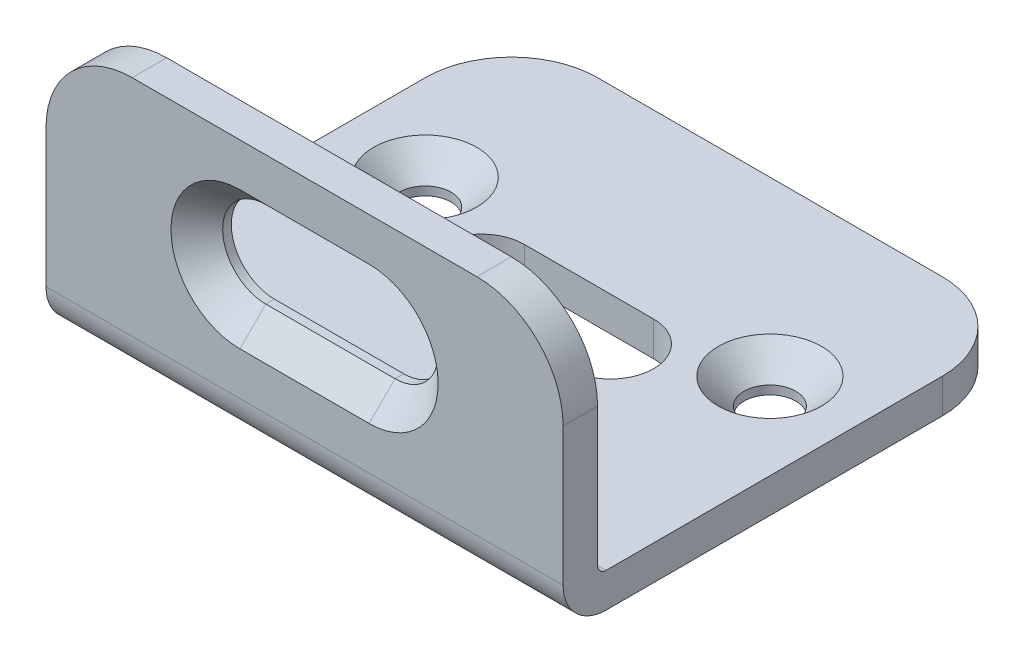
ISO-10303-21;
HEADER;
FILE_DESCRIPTION(('STEP AP214'),'2;1');
FILE_NAME('part.step','',(''),(''),'','','');
FILE_SCHEMA(('AUTOMOTIVE_DESIGN { 1 0 10303 214 1 1 1 1 }'));
ENDSEC;
DATA;
#1=APPLICATION_CONTEXT('core data for automotive mechanical design processes');
#2=APPLICATION_PROTOCOL_DEFINITION('international standard','automotive_design',2000,#1);
#3=PRODUCT_CONTEXT('',#1,'mechanical');
#4=PRODUCT('Part','Part','',(#3));
#5=PRODUCT_RELATED_PRODUCT_CATEGORY('part','',(#4));
#6=PRODUCT_DEFINITION_FORMATION('','',#4);
#7=PRODUCT_DEFINITION_CONTEXT('part definition',#1,'design');
#8=PRODUCT_DEFINITION('design','',#6,#7);
#9=PRODUCT_DEFINITION_SHAPE('','',#8);
#10=(LENGTH_UNIT() NAMED_UNIT(*) SI_UNIT(.MILLI.,.METRE.));
#11=(NAMED_UNIT(*) PLANE_ANGLE_UNIT() SI_UNIT($,.RADIAN.));
#12=(NAMED_UNIT(*) SI_UNIT($,.STERADIAN.) SOLID_ANGLE_UNIT());
#13=UNCERTAINTY_MEASURE_WITH_UNIT(LENGTH_MEASURE(1.E-05),#10,'distance_accuracy_value','');
#14=(GEOMETRIC_REPRESENTATION_CONTEXT(3) GLOBAL_UNCERTAINTY_ASSIGNED_CONTEXT((#13)) GLOBAL_UNIT_ASSIGNED_CONTEXT((#10,
#11,#12)) REPRESENTATION_CONTEXT('',''));
#15=CARTESIAN_POINT('',(0.,0.,0.));
#16=DIRECTION('',(0.,0.,1.));
#17=DIRECTION('',(1.,0.,0.));
#18=AXIS2_PLACEMENT_3D('',#15,#16,#17);
#19=CARTESIAN_POINT('',(22.5,14.,0.));
#20=DIRECTION('',(0.,0.,1.));
#21=DIRECTION('',(1.,0.,0.));
#22=AXIS2_PLACEMENT_3D('',#19,#20,#21);
#23=CYLINDRICAL_SURFACE('',#22,5.);
#24=CARTESIAN_POINT('',(22.5,14.,1.0000000000332));
#25=DIRECTION('',(0.,0.,1.));
#26=DIRECTION('',(1.,0.,0.));
#27=AXIS2_PLACEMENT_3D('',#24,#25,#26);
#28=CIRCLE('',#27,4.99999999991814);
#29=CARTESIAN_POINT('',(22.5,18.9999999999795,1.00000000000828));
#30=VERTEX_POINT('',#29);
#31=CARTESIAN_POINT('',(22.5,9.00000000002046,1.00000000000828));
#32=VERTEX_POINT('',#31);
#33=EDGE_CURVE('E188',#30,#32,#28,.T.);
#34=ORIENTED_EDGE('',*,*,#33,.T.);
#35=DIRECTION('',(0.,0.,1.));
#36=VECTOR('',#35,1.);
#37=CARTESIAN_POINT('',(22.5,9.,0.));
#38=LINE('',#37,#36);
#39=CARTESIAN_POINT('',(22.5,9.,0.));
#40=VERTEX_POINT('',#39);
#41=EDGE_CURVE('E140',#32,#40,#38,.F.);
#42=ORIENTED_EDGE('',*,*,#41,.T.);
#43=CARTESIAN_POINT('',(22.5,14.,0.));
#44=DIRECTION('',(0.,0.,1.));
#45=DIRECTION('',(1.,0.,0.));
#46=AXIS2_PLACEMENT_3D('',#43,#44,#45);
#47=CIRCLE('',#46,5.);
#48=CARTESIAN_POINT('',(22.5,19.,0.));
#49=VERTEX_POINT('',#48);
#50=EDGE_CURVE('E20',#40,#49,#47,.F.);
#51=ORIENTED_EDGE('',*,*,#50,.T.);
#52=DIRECTION('',(0.,0.,1.));
#53=VECTOR('',#52,1.);
#54=CARTESIAN_POINT('',(22.5,19.,0.));
#55=LINE('',#54,#53);
#56=EDGE_CURVE('E145',#49,#30,#55,.T.);
#57=ORIENTED_EDGE('',*,*,#56,.T.);
#58=EDGE_LOOP('',(#34,#42,#51,#57));
#59=FACE_BOUND('',#58,.T.);
#60=ADVANCED_FACE('F17',(#59),#23,.F.);
#61=CARTESIAN_POINT('',(37.5,19.,0.));
#62=DIRECTION('',(0.,1.,0.));
#63=DIRECTION('',(-1.,0.,0.));
#64=AXIS2_PLACEMENT_3D('',#61,#62,#63);
#65=PLANE('',#64);
#66=DIRECTION('',(1.,0.,0.));
#67=VECTOR('',#66,1.);
#68=CARTESIAN_POINT('',(37.5,19.,0.999999999999974));
#69=LINE('',#68,#67);
#70=CARTESIAN_POINT('',(37.5,18.9999999999633,0.999999999982258));
#71=VERTEX_POINT('',#70);
#72=EDGE_CURVE('E158',#30,#71,#69,.T.);
#73=ORIENTED_EDGE('',*,*,#72,.F.);
#74=ORIENTED_EDGE('',*,*,#56,.F.);
#75=DIRECTION('',(1.,0.,0.));
#76=VECTOR('',#75,1.);
#77=CARTESIAN_POINT('',(60.,19.,0.));
#78=LINE('',#77,#76);
#79=CARTESIAN_POINT('',(37.5,19.,0.));
#80=VERTEX_POINT('',#79);
#81=EDGE_CURVE('E150',#49,#80,#78,.T.);
#82=ORIENTED_EDGE('',*,*,#81,.T.);
#83=DIRECTION('',(0.,0.,1.));
#84=VECTOR('',#83,1.);
#85=CARTESIAN_POINT('',(37.5,19.,0.));
#86=LINE('',#85,#84);
#87=EDGE_CURVE('E160',#80,#71,#86,.T.);
#88=ORIENTED_EDGE('',*,*,#87,.T.);
#89=EDGE_LOOP('',(#73,#74,#82,#88));
#90=FACE_BOUND('',#89,.T.);
#91=ADVANCED_FACE('F154',(#90),#65,.F.);
#92=CARTESIAN_POINT('',(37.5,14.,0.));
#93=DIRECTION('',(0.,0.,1.));
#94=DIRECTION('',(1.,0.,0.));
#95=AXIS2_PLACEMENT_3D('',#92,#93,#94);
#96=CYLINDRICAL_SURFACE('',#95,5.);
#97=CARTESIAN_POINT('',(37.5,14.,0.));
#98=DIRECTION('',(0.,0.,1.));
#99=DIRECTION('',(1.,0.,0.));
#100=AXIS2_PLACEMENT_3D('',#97,#98,#99);
#101=CIRCLE('',#100,5.);
#102=CARTESIAN_POINT('',(37.5,9.,0.));
#103=VERTEX_POINT('',#102);
#104=EDGE_CURVE('E163',#80,#103,#101,.F.);
#105=ORIENTED_EDGE('',*,*,#104,.T.);
#106=DIRECTION('',(0.,0.,1.));
#107=VECTOR('',#106,1.);
#108=CARTESIAN_POINT('',(37.5,9.,0.));
#109=LINE('',#108,#107);
#110=CARTESIAN_POINT('',(37.5,9.00000000000966,1.00000000000828));
#111=VERTEX_POINT('',#110);
#112=EDGE_CURVE('E183',#103,#111,#109,.T.);
#113=ORIENTED_EDGE('',*,*,#112,.T.);
#114=CARTESIAN_POINT('',(37.5,14.,1.0000000000332));
#115=DIRECTION('',(0.,0.,1.));
#116=DIRECTION('',(1.,0.,0.));
#117=AXIS2_PLACEMENT_3D('',#114,#115,#116);
#118=CIRCLE('',#117,4.99999999996134);
#119=EDGE_CURVE('E169',#111,#71,#118,.T.);
#120=ORIENTED_EDGE('',*,*,#119,.T.);
#121=ORIENTED_EDGE('',*,*,#87,.F.);
#122=EDGE_LOOP('',(#105,#113,#120,#121));
#123=FACE_BOUND('',#122,.T.);
#124=ADVANCED_FACE('F297',(#123),#96,.F.);
#125=CARTESIAN_POINT('',(37.5,9.,0.));
#126=DIRECTION('',(0.,-1.,0.));
#127=DIRECTION('',(1.,0.,0.));
#128=AXIS2_PLACEMENT_3D('',#125,#126,#127);
#129=PLANE('',#128);
#130=DIRECTION('',(1.,0.,0.));
#131=VECTOR('',#130,1.);
#132=CARTESIAN_POINT('',(37.5,9.,0.999999999999979));
#133=LINE('',#132,#131);
#134=EDGE_CURVE('E176',#111,#32,#133,.F.);
#135=ORIENTED_EDGE('',*,*,#134,.F.);
#136=ORIENTED_EDGE('',*,*,#112,.F.);
#137=DIRECTION('',(1.,0.,0.));
#138=VECTOR('',#137,1.);
#139=CARTESIAN_POINT('',(60.,9.,0.));
#140=LINE('',#139,#138);
#141=EDGE_CURVE('E165',#103,#40,#140,.F.);
#142=ORIENTED_EDGE('',*,*,#141,.T.);
#143=ORIENTED_EDGE('',*,*,#41,.F.);
#144=EDGE_LOOP('',(#135,#136,#142,#143));
#145=FACE_BOUND('',#144,.T.);
#146=ADVANCED_FACE('F292',(#145),#129,.F.);
#147=CARTESIAN_POINT('',(60.,0.,0.));
#148=DIRECTION('',(0.,0.,1.));
#149=DIRECTION('',(1.,0.,0.));
#150=AXIS2_PLACEMENT_3D('',#147,#148,#149);
#151=PLANE('',#150);
#152=CARTESIAN_POINT('',(10.,17.,0.));
#153=DIRECTION('',(0.,0.,-1.));
#154=DIRECTION('',(-1.,0.,0.));
#155=AXIS2_PLACEMENT_3D('',#152,#153,#154);
#156=CIRCLE('',#155,10.);
#157=CARTESIAN_POINT('',(10.,27.,0.));
#158=VERTEX_POINT('',#157);
#159=CARTESIAN_POINT('',(0.,17.,0.));
#160=VERTEX_POINT('',#159);
#161=EDGE_CURVE('E282',#158,#160,#156,.F.);
#162=ORIENTED_EDGE('',*,*,#161,.F.);
#163=DIRECTION('',(1.,0.,0.));
#164=VECTOR('',#163,1.);
#165=CARTESIAN_POINT('',(60.,27.,0.));
#166=LINE('',#165,#164);
#167=CARTESIAN_POINT('',(50.,27.,0.));
#168=VERTEX_POINT('',#167);
#169=EDGE_CURVE('E179',#168,#158,#166,.F.);
#170=ORIENTED_EDGE('',*,*,#169,.F.);
#171=CARTESIAN_POINT('',(50.,17.,0.));
#172=DIRECTION('',(0.,0.,-1.));
#173=DIRECTION('',(-1.,0.,0.));
#174=AXIS2_PLACEMENT_3D('',#171,#172,#173);
#175=CIRCLE('',#174,10.);
#176=CARTESIAN_POINT('',(60.,17.,0.));
#177=VERTEX_POINT('',#176);
#178=EDGE_CURVE('E278',#177,#168,#175,.F.);
#179=ORIENTED_EDGE('',*,*,#178,.F.);
#180=DIRECTION('',(0.,1.,0.));
#181=VECTOR('',#180,1.);
#182=CARTESIAN_POINT('',(60.,1.,0.));
#183=LINE('',#182,#181);
#184=CARTESIAN_POINT('',(60.,1.,0.));
#185=VERTEX_POINT('',#184);
#186=EDGE_CURVE('E319',#185,#177,#183,.T.);
#187=ORIENTED_EDGE('',*,*,#186,.F.);
#188=DIRECTION('',(-1.,0.,0.));
#189=VECTOR('',#188,1.);
#190=CARTESIAN_POINT('',(60.,1.,0.));
#191=LINE('',#190,#189);
#192=CARTESIAN_POINT('',(0.,1.,0.));
#193=VERTEX_POINT('',#192);
#194=EDGE_CURVE('E205',#185,#193,#191,.T.);
#195=ORIENTED_EDGE('',*,*,#194,.T.);
#196=DIRECTION('',(0.,1.,0.));
#197=VECTOR('',#196,1.);
#198=CARTESIAN_POINT('',(0.,-4.,0.));
#199=LINE('',#198,#197);
#200=EDGE_CURVE('E321',#160,#193,#199,.F.);
#201=ORIENTED_EDGE('',*,*,#200,.F.);
#202=EDGE_LOOP('',(#162,#170,#179,#187,#195,#201));
#203=FACE_BOUND('',#202,.T.);
#204=ORIENTED_EDGE('',*,*,#104,.F.);
#205=ORIENTED_EDGE('',*,*,#81,.F.);
#206=ORIENTED_EDGE('',*,*,#50,.F.);
#207=ORIENTED_EDGE('',*,*,#141,.F.);
#208=EDGE_LOOP('',(#204,#205,#206,#207));
#209=FACE_BOUND('',#208,.T.);
#210=ADVANCED_FACE('F162',(#203,#209),#151,.F.);
#211=CARTESIAN_POINT('',(60.,1.,-1.));
#212=DIRECTION('',(-1.,0.,0.));
#213=DIRECTION('',(0.,0.,1.));
#214=AXIS2_PLACEMENT_3D('',#211,#212,#213);
#215=CYLINDRICAL_SURFACE('',#214,1.);
#216=ORIENTED_EDGE('',*,*,#194,.F.);
#217=CARTESIAN_POINT('',(60.,1.,-1.));
#218=DIRECTION('',(-1.,0.,0.));
#219=DIRECTION('',(0.,0.,1.));
#220=AXIS2_PLACEMENT_3D('',#217,#218,#219);
#221=CIRCLE('',#220,1.);
#222=CARTESIAN_POINT('',(60.,0.,-1.));
#223=VERTEX_POINT('',#222);
#224=EDGE_CURVE('E207',#223,#185,#221,.T.);
#225=ORIENTED_EDGE('',*,*,#224,.F.);
#226=DIRECTION('',(1.,0.,0.));
#227=VECTOR('',#226,1.);
#228=CARTESIAN_POINT('',(60.,0.,-1.));
#229=LINE('',#228,#227);
#230=CARTESIAN_POINT('',(0.,0.,-1.));
#231=VERTEX_POINT('',#230);
#232=EDGE_CURVE('E270',#223,#231,#229,.F.);
#233=ORIENTED_EDGE('',*,*,#232,.T.);
#234=CARTESIAN_POINT('',(0.,1.,-1.));
#235=DIRECTION('',(-1.,0.,0.));
#236=DIRECTION('',(0.,0.,1.));
#237=AXIS2_PLACEMENT_3D('',#234,#235,#236);
#238=CIRCLE('',#237,1.);
#239=EDGE_CURVE('E191',#193,#231,#238,.F.);
#240=ORIENTED_EDGE('',*,*,#239,.F.);
#241=EDGE_LOOP('',(#216,#225,#233,#240));
#242=FACE_BOUND('',#241,.T.);
#243=ADVANCED_FACE('F427',(#242),#215,.F.);
#244=CARTESIAN_POINT('',(22.5,14.,3.99999999996226));
#245=DIRECTION('',(0.,0.,1.));
#246=DIRECTION('',(1.,0.,0.));
#247=AXIS2_PLACEMENT_3D('',#244,#245,#246);
#248=CONICAL_SURFACE('',#247,7.99999999990404,0.785398163397448);
#249=ORIENTED_EDGE('',*,*,#33,.F.);
#250=DIRECTION('',(0.,-0.707106781186548,-0.707106781186548));
#251=VECTOR('',#250,1.);
#252=CARTESIAN_POINT('',(22.5,19.,0.999999999999984));
#253=LINE('',#252,#251);
#254=CARTESIAN_POINT('',(22.5,22.0000000000095,4.00000000000955));
#255=VERTEX_POINT('',#254);
#256=EDGE_CURVE('E190',#255,#30,#253,.T.);
#257=ORIENTED_EDGE('',*,*,#256,.F.);
#258=CARTESIAN_POINT('',(22.5,14.,4.0000000000191));
#259=DIRECTION('',(0.,0.,1.));
#260=DIRECTION('',(1.,0.,0.));
#261=AXIS2_PLACEMENT_3D('',#258,#259,#260);
#262=CIRCLE('',#261,7.99999999996089);
#263=CARTESIAN_POINT('',(22.5,5.99999999999042,4.00000000000955));
#264=VERTEX_POINT('',#263);
#265=EDGE_CURVE('E267',#264,#255,#262,.F.);
#266=ORIENTED_EDGE('',*,*,#265,.F.);
#267=DIRECTION('',(0.,-0.707106781186548,0.707106781186547));
#268=VECTOR('',#267,1.);
#269=CARTESIAN_POINT('',(22.5,9.,0.999999999999977));
#270=LINE('',#269,#268);
#271=EDGE_CURVE('E172',#32,#264,#270,.T.);
#272=ORIENTED_EDGE('',*,*,#271,.F.);
#273=EDGE_LOOP('',(#249,#257,#266,#272));
#274=FACE_BOUND('',#273,.T.);
#275=ADVANCED_FACE('F657',(#274),#248,.F.);
#276=CARTESIAN_POINT('',(37.5,19.,0.999999999999979));
#277=DIRECTION('',(0.,-0.707106781186548,0.707106781186548));
#278=DIRECTION('',(0.,-0.707106781186548,-0.707106781186548));
#279=AXIS2_PLACEMENT_3D('',#276,#277,#278);
#280=PLANE('',#279);
#281=ORIENTED_EDGE('',*,*,#256,.T.);
#282=ORIENTED_EDGE('',*,*,#72,.T.);
#283=DIRECTION('',(0.,-0.707106781186548,-0.707106781186547));
#284=VECTOR('',#283,1.);
#285=CARTESIAN_POINT('',(37.5000000000306,498976.5,498958.5));
#286=LINE('',#285,#284);
#287=CARTESIAN_POINT('',(37.5,21.9999999999907,4.0000000000191));
#288=VERTEX_POINT('',#287);
#289=EDGE_CURVE('E173',#71,#288,#286,.F.);
#290=ORIENTED_EDGE('',*,*,#289,.T.);
#291=DIRECTION('',(1.,0.,0.));
#292=VECTOR('',#291,1.);
#293=CARTESIAN_POINT('',(60.,22.,4.));
#294=LINE('',#293,#292);
#295=EDGE_CURVE('E266',#255,#288,#294,.T.);
#296=ORIENTED_EDGE('',*,*,#295,.F.);
#297=EDGE_LOOP('',(#281,#282,#290,#296));
#298=FACE_BOUND('',#297,.T.);
#299=ADVANCED_FACE('F649',(#298),#280,.T.);
#300=CARTESIAN_POINT('',(37.5,14.,3.99999999996226));
#301=DIRECTION('',(0.,0.,1.));
#302=DIRECTION('',(1.,0.,0.));
#303=AXIS2_PLACEMENT_3D('',#300,#301,#302);
#304=CONICAL_SURFACE('',#303,7.9999999998904,0.785398163387975);
#305=ORIENTED_EDGE('',*,*,#119,.F.);
#306=DIRECTION('',(0.,-0.707106781186548,0.707106781186547));
#307=VECTOR('',#306,1.);
#308=CARTESIAN_POINT('',(37.5,9.,0.999999999999979));
#309=LINE('',#308,#307);
#310=CARTESIAN_POINT('',(37.5,5.99999999999042,4.00000000000955));
#311=VERTEX_POINT('',#310);
#312=EDGE_CURVE('E180',#311,#111,#309,.F.);
#313=ORIENTED_EDGE('',*,*,#312,.F.);
#314=CARTESIAN_POINT('',(37.5,14.,4.0000000000191));
#315=DIRECTION('',(0.,0.,1.));
#316=DIRECTION('',(1.,0.,0.));
#317=AXIS2_PLACEMENT_3D('',#314,#315,#316);
#318=CIRCLE('',#317,7.99999999994724);
#319=EDGE_CURVE('E262',#288,#311,#318,.F.);
#320=ORIENTED_EDGE('',*,*,#319,.F.);
#321=ORIENTED_EDGE('',*,*,#289,.F.);
#322=EDGE_LOOP('',(#305,#313,#320,#321));
#323=FACE_BOUND('',#322,.T.);
#324=ADVANCED_FACE('F302',(#323),#304,.F.);
#325=CARTESIAN_POINT('',(37.5,9.,0.999999999999979));
#326=DIRECTION('',(0.,0.707106781186547,0.707106781186548));
#327=DIRECTION('',(0.,-0.707106781186548,0.707106781186547));
#328=AXIS2_PLACEMENT_3D('',#325,#326,#327);
#329=PLANE('',#328);
#330=ORIENTED_EDGE('',*,*,#312,.T.);
#331=ORIENTED_EDGE('',*,*,#134,.T.);
#332=ORIENTED_EDGE('',*,*,#271,.T.);
#333=DIRECTION('',(1.,0.,0.));
#334=VECTOR('',#333,1.);
#335=CARTESIAN_POINT('',(60.,6.,4.));
#336=LINE('',#335,#334);
#337=EDGE_CURVE('E265',#311,#264,#336,.F.);
#338=ORIENTED_EDGE('',*,*,#337,.F.);
#339=EDGE_LOOP('',(#330,#331,#332,#338));
#340=FACE_BOUND('',#339,.T.);
#341=ADVANCED_FACE('F339',(#340),#329,.T.);
#342=CARTESIAN_POINT('',(60.,27.,4.));
#343=DIRECTION('',(0.,1.,0.));
#344=DIRECTION('',(0.,0.,1.));
#345=AXIS2_PLACEMENT_3D('',#342,#343,#344);
#346=PLANE('',#345);
#347=DIRECTION('',(1.,0.,0.));
#348=VECTOR('',#347,1.);
#349=CARTESIAN_POINT('',(60.,27.,4.));
#350=LINE('',#349,#348);
#351=CARTESIAN_POINT('',(50.,27.,4.));
#352=VERTEX_POINT('',#351);
#353=CARTESIAN_POINT('',(10.,27.,4.));
#354=VERTEX_POINT('',#353);
#355=EDGE_CURVE('E261',#352,#354,#350,.F.);
#356=ORIENTED_EDGE('',*,*,#355,.F.);
#357=DIRECTION('',(0.,0.,-1.));
#358=VECTOR('',#357,1.);
#359=CARTESIAN_POINT('',(50.,27.,4.));
#360=LINE('',#359,#358);
#361=EDGE_CURVE('E277',#168,#352,#360,.F.);
#362=ORIENTED_EDGE('',*,*,#361,.F.);
#363=ORIENTED_EDGE('',*,*,#169,.T.);
#364=DIRECTION('',(0.,0.,-1.));
#365=VECTOR('',#364,1.);
#366=CARTESIAN_POINT('',(10.,27.,-1.));
#367=LINE('',#366,#365);
#368=EDGE_CURVE('E285',#354,#158,#367,.T.);
#369=ORIENTED_EDGE('',*,*,#368,.F.);
#370=EDGE_LOOP('',(#356,#362,#363,#369));
#371=FACE_BOUND('',#370,.T.);
#372=ADVANCED_FACE('F381',(#371),#346,.T.);
#373=CARTESIAN_POINT('',(10.,17.,-1.));
#374=DIRECTION('',(0.,0.,-1.));
#375=DIRECTION('',(-1.,0.,0.));
#376=AXIS2_PLACEMENT_3D('',#373,#374,#375);
#377=CYLINDRICAL_SURFACE('',#376,10.);
#378=ORIENTED_EDGE('',*,*,#161,.T.);
#379=DIRECTION('',(0.,0.,1.));
#380=VECTOR('',#379,1.);
#381=CARTESIAN_POINT('',(0.,17.,-1.));
#382=LINE('',#381,#380);
#383=CARTESIAN_POINT('',(0.,17.,4.));
#384=VERTEX_POINT('',#383);
#385=EDGE_CURVE('E284',#384,#160,#382,.F.);
#386=ORIENTED_EDGE('',*,*,#385,.F.);
#387=CARTESIAN_POINT('',(10.,17.,4.));
#388=DIRECTION('',(0.,0.,-1.));
#389=DIRECTION('',(-1.,0.,0.));
#390=AXIS2_PLACEMENT_3D('',#387,#388,#389);
#391=CIRCLE('',#390,10.);
#392=EDGE_CURVE('E257',#354,#384,#391,.F.);
#393=ORIENTED_EDGE('',*,*,#392,.F.);
#394=ORIENTED_EDGE('',*,*,#368,.T.);
#395=EDGE_LOOP('',(#378,#386,#393,#394));
#396=FACE_BOUND('',#395,.T.);
#397=ADVANCED_FACE('F433',(#396),#377,.T.);
#398=CARTESIAN_POINT('',(50.,17.,4.));
#399=DIRECTION('',(0.,0.,-1.));
#400=DIRECTION('',(-1.,0.,0.));
#401=AXIS2_PLACEMENT_3D('',#398,#399,#400);
#402=CYLINDRICAL_SURFACE('',#401,10.);
#403=ORIENTED_EDGE('',*,*,#178,.T.);
#404=ORIENTED_EDGE('',*,*,#361,.T.);
#405=CARTESIAN_POINT('',(50.,17.,4.));
#406=DIRECTION('',(0.,0.,-1.));
#407=DIRECTION('',(-1.,0.,0.));
#408=AXIS2_PLACEMENT_3D('',#405,#406,#407);
#409=CIRCLE('',#408,10.);
#410=CARTESIAN_POINT('',(60.,17.,4.));
#411=VERTEX_POINT('',#410);
#412=EDGE_CURVE('E252',#411,#352,#409,.F.);
#413=ORIENTED_EDGE('',*,*,#412,.F.);
#414=DIRECTION('',(0.,0.,-1.));
#415=VECTOR('',#414,1.);
#416=CARTESIAN_POINT('',(60.,17.,4.));
#417=LINE('',#416,#415);
#418=EDGE_CURVE('E281',#411,#177,#417,.T.);
#419=ORIENTED_EDGE('',*,*,#418,.T.);
#420=EDGE_LOOP('',(#403,#404,#413,#419));
#421=FACE_BOUND('',#420,.T.);
#422=ADVANCED_FACE('F373',(#421),#402,.T.);
#423=CARTESIAN_POINT('',(10.,1.13686837721616E-10,-30.));
#424=DIRECTION('',(0.,1.,0.));
#425=DIRECTION('',(0.,0.,1.));
#426=AXIS2_PLACEMENT_3D('',#423,#424,#425);
#427=CONICAL_SURFACE('',#426,6.00000000011278,0.785398163397448);
#428=CARTESIAN_POINT('',(10.,0.,-30.));
#429=DIRECTION('',(0.,1.,0.));
#430=DIRECTION('',(0.,0.,1.));
#431=AXIS2_PLACEMENT_3D('',#428,#429,#430);
#432=CIRCLE('',#431,5.99999999999909);
#433=CARTESIAN_POINT('',(10.,0.,-24.0000000000009));
#434=VERTEX_POINT('',#433);
#435=EDGE_CURVE('E274',#434,#434,#432,.T.);
#436=ORIENTED_EDGE('',*,*,#435,.T.);
#437=EDGE_LOOP('',(#436));
#438=FACE_BOUND('',#437,.T.);
#439=CARTESIAN_POINT('',(10.,-3.,-30.));
#440=DIRECTION('',(0.,-1.,0.));
#441=DIRECTION('',(0.,0.,-1.));
#442=AXIS2_PLACEMENT_3D('',#439,#440,#441);
#443=CIRCLE('',#442,3.);
#444=CARTESIAN_POINT('',(10.,-3.,-33.));
#445=VERTEX_POINT('',#444);
#446=EDGE_CURVE('E255',#445,#445,#443,.T.);
#447=ORIENTED_EDGE('',*,*,#446,.T.);
#448=EDGE_LOOP('',(#447));
#449=FACE_BOUND('',#448,.T.);
#450=ADVANCED_FACE('F604',(#438,#449),#427,.F.);
#451=CARTESIAN_POINT('',(50.,-1.70530256582424E-10,-30.));
#452=DIRECTION('',(0.,1.,0.));
#453=DIRECTION('',(0.,0.,1.));
#454=AXIS2_PLACEMENT_3D('',#451,#452,#453);
#455=CONICAL_SURFACE('',#454,5.9999999998854,0.785398163397448);
#456=CARTESIAN_POINT('',(50.,0.,-30.));
#457=DIRECTION('',(0.,1.,0.));
#458=DIRECTION('',(0.,0.,1.));
#459=AXIS2_PLACEMENT_3D('',#456,#457,#458);
#460=CIRCLE('',#459,6.00000000005593);
#461=CARTESIAN_POINT('',(50.,0.,-23.9999999999441));
#462=VERTEX_POINT('',#461);
#463=EDGE_CURVE('E271',#462,#462,#460,.T.);
#464=ORIENTED_EDGE('',*,*,#463,.T.);
#465=EDGE_LOOP('',(#464));
#466=FACE_BOUND('',#465,.T.);
#467=CARTESIAN_POINT('',(50.,-3.,-30.));
#468=DIRECTION('',(0.,-1.,0.));
#469=DIRECTION('',(0.,0.,-1.));
#470=AXIS2_PLACEMENT_3D('',#467,#468,#469);
#471=CIRCLE('',#470,3.);
#472=CARTESIAN_POINT('',(50.,-3.,-33.));
#473=VERTEX_POINT('',#472);
#474=EDGE_CURVE('E251',#473,#473,#471,.T.);
#475=ORIENTED_EDGE('',*,*,#474,.T.);
#476=EDGE_LOOP('',(#475));
#477=FACE_BOUND('',#476,.T.);
#478=ADVANCED_FACE('F596',(#466,#477),#455,.F.);
#479=CARTESIAN_POINT('',(60.,0.,0.));
#480=DIRECTION('',(0.,-1.,0.));
#481=DIRECTION('',(0.,0.,-1.));
#482=AXIS2_PLACEMENT_3D('',#479,#480,#481);
#483=PLANE('',#482);
#484=CARTESIAN_POINT('',(10.,0.,-40.));
#485=DIRECTION('',(0.,1.,0.));
#486=DIRECTION('',(0.,0.,1.));
#487=AXIS2_PLACEMENT_3D('',#484,#485,#486);
#488=CIRCLE('',#487,10.);
#489=CARTESIAN_POINT('',(0.,0.,-40.));
#490=VERTEX_POINT('',#489);
#491=CARTESIAN_POINT('',(10.,0.,-50.));
#492=VERTEX_POINT('',#491);
#493=EDGE_CURVE('E240',#490,#492,#488,.F.);
#494=ORIENTED_EDGE('',*,*,#493,.F.);
#495=DIRECTION('',(0.,0.,-1.));
#496=VECTOR('',#495,1.);
#497=CARTESIAN_POINT('',(0.,0.,-1.));
#498=LINE('',#497,#496);
#499=EDGE_CURVE('E243',#490,#231,#498,.F.);
#500=ORIENTED_EDGE('',*,*,#499,.T.);
#501=ORIENTED_EDGE('',*,*,#232,.F.);
#502=DIRECTION('',(0.,0.,-1.));
#503=VECTOR('',#502,1.);
#504=CARTESIAN_POINT('',(60.,0.,4.));
#505=LINE('',#504,#503);
#506=CARTESIAN_POINT('',(60.,0.,-40.));
#507=VERTEX_POINT('',#506);
#508=EDGE_CURVE('E235',#507,#223,#505,.F.);
#509=ORIENTED_EDGE('',*,*,#508,.F.);
#510=CARTESIAN_POINT('',(50.,0.,-40.));
#511=DIRECTION('',(0.,-1.,0.));
#512=DIRECTION('',(0.,0.,-1.));
#513=AXIS2_PLACEMENT_3D('',#510,#511,#512);
#514=CIRCLE('',#513,10.);
#515=CARTESIAN_POINT('',(50.,0.,-50.));
#516=VERTEX_POINT('',#515);
#517=EDGE_CURVE('E236',#516,#507,#514,.T.);
#518=ORIENTED_EDGE('',*,*,#517,.F.);
#519=DIRECTION('',(-1.,0.,0.));
#520=VECTOR('',#519,1.);
#521=CARTESIAN_POINT('',(60.,0.,-50.));
#522=LINE('',#521,#520);
#523=EDGE_CURVE('E239',#492,#516,#522,.F.);
#524=ORIENTED_EDGE('',*,*,#523,.F.);
#525=EDGE_LOOP('',(#494,#500,#501,#509,#518,#524));
#526=FACE_BOUND('',#525,.T.);
#527=CARTESIAN_POINT('',(37.5,0.,-24.));
#528=DIRECTION('',(0.,-1.,0.));
#529=DIRECTION('',(0.,0.,-1.));
#530=AXIS2_PLACEMENT_3D('',#527,#528,#529);
#531=CIRCLE('',#530,5.);
#532=CARTESIAN_POINT('',(37.5,0.,-29.));
#533=VERTEX_POINT('',#532);
#534=CARTESIAN_POINT('',(37.5,0.,-19.));
#535=VERTEX_POINT('',#534);
#536=EDGE_CURVE('E248',#533,#535,#531,.T.);
#537=ORIENTED_EDGE('',*,*,#536,.T.);
#538=DIRECTION('',(1.,0.,0.));
#539=VECTOR('',#538,1.);
#540=CARTESIAN_POINT('',(37.5,0.,-19.));
#541=LINE('',#540,#539);
#542=CARTESIAN_POINT('',(22.5,0.,-19.));
#543=VERTEX_POINT('',#542);
#544=EDGE_CURVE('E361',#535,#543,#541,.F.);
#545=ORIENTED_EDGE('',*,*,#544,.T.);
#546=CARTESIAN_POINT('',(22.5,0.,-24.));
#547=DIRECTION('',(0.,-1.,0.));
#548=DIRECTION('',(0.,0.,-1.));
#549=AXIS2_PLACEMENT_3D('',#546,#547,#548);
#550=CIRCLE('',#549,5.);
#551=CARTESIAN_POINT('',(22.5,0.,-29.));
#552=VERTEX_POINT('',#551);
#553=EDGE_CURVE('E244',#543,#552,#550,.T.);
#554=ORIENTED_EDGE('',*,*,#553,.T.);
#555=DIRECTION('',(-1.,0.,0.));
#556=VECTOR('',#555,1.);
#557=CARTESIAN_POINT('',(37.5,0.,-29.));
#558=LINE('',#557,#556);
#559=EDGE_CURVE('E250',#552,#533,#558,.F.);
#560=ORIENTED_EDGE('',*,*,#559,.T.);
#561=EDGE_LOOP('',(#537,#545,#554,#560));
#562=FACE_BOUND('',#561,.T.);
#563=ORIENTED_EDGE('',*,*,#463,.F.);
#564=EDGE_LOOP('',(#563));
#565=FACE_BOUND('',#564,.T.);
#566=ORIENTED_EDGE('',*,*,#435,.F.);
#567=EDGE_LOOP('',(#566));
#568=FACE_BOUND('',#567,.T.);
#569=ADVANCED_FACE('F422',(#526,#562,#565,#568),#483,.F.);
#570=CARTESIAN_POINT('',(60.,0.,4.));
#571=DIRECTION('',(0.,0.,1.));
#572=DIRECTION('',(1.,0.,0.));
#573=AXIS2_PLACEMENT_3D('',#570,#571,#572);
#574=PLANE('',#573);
#575=DIRECTION('',(0.,1.,0.));
#576=VECTOR('',#575,1.);
#577=CARTESIAN_POINT('',(60.,0.,4.));
#578=LINE('',#577,#576);
#579=CARTESIAN_POINT('',(60.,1.,4.));
#580=VERTEX_POINT('',#579);
#581=EDGE_CURVE('E256',#580,#411,#578,.T.);
#582=ORIENTED_EDGE('',*,*,#581,.T.);
#583=ORIENTED_EDGE('',*,*,#412,.T.);
#584=ORIENTED_EDGE('',*,*,#355,.T.);
#585=ORIENTED_EDGE('',*,*,#392,.T.);
#586=DIRECTION('',(0.,1.,0.));
#587=VECTOR('',#586,1.);
#588=CARTESIAN_POINT('',(0.,0.,4.));
#589=LINE('',#588,#587);
#590=CARTESIAN_POINT('',(0.,1.,4.));
#591=VERTEX_POINT('',#590);
#592=EDGE_CURVE('E260',#384,#591,#589,.F.);
#593=ORIENTED_EDGE('',*,*,#592,.T.);
#594=DIRECTION('',(-1.,0.,0.));
#595=VECTOR('',#594,1.);
#596=CARTESIAN_POINT('',(60.,1.,4.));
#597=LINE('',#596,#595);
#598=EDGE_CURVE('E230',#580,#591,#597,.T.);
#599=ORIENTED_EDGE('',*,*,#598,.F.);
#600=EDGE_LOOP('',(#582,#583,#584,#585,#593,#599));
#601=FACE_BOUND('',#600,.T.);
#602=ORIENTED_EDGE('',*,*,#319,.T.);
#603=ORIENTED_EDGE('',*,*,#337,.T.);
#604=ORIENTED_EDGE('',*,*,#265,.T.);
#605=ORIENTED_EDGE('',*,*,#295,.T.);
#606=EDGE_LOOP('',(#602,#603,#604,#605));
#607=FACE_BOUND('',#606,.T.);
#608=ADVANCED_FACE('F342',(#601,#607),#574,.T.);
#609=CARTESIAN_POINT('',(10.,0.,-30.));
#610=DIRECTION('',(0.,-1.,0.));
#611=DIRECTION('',(0.,0.,-1.));
#612=AXIS2_PLACEMENT_3D('',#609,#610,#611);
#613=CYLINDRICAL_SURFACE('',#612,3.);
#614=CARTESIAN_POINT('',(10.,-4.,-30.));
#615=DIRECTION('',(0.,-1.,0.));
#616=DIRECTION('',(0.,0.,-1.));
#617=AXIS2_PLACEMENT_3D('',#614,#615,#616);
#618=CIRCLE('',#617,3.);
#619=CARTESIAN_POINT('',(10.,-4.,-33.));
#620=VERTEX_POINT('',#619);
#621=EDGE_CURVE('E227',#620,#620,#618,.F.);
#622=ORIENTED_EDGE('',*,*,#621,.F.);
#623=EDGE_LOOP('',(#622));
#624=FACE_BOUND('',#623,.T.);
#625=ORIENTED_EDGE('',*,*,#446,.F.);
#626=EDGE_LOOP('',(#625));
#627=FACE_BOUND('',#626,.T.);
#628=ADVANCED_FACE('F572',(#624,#627),#613,.F.);
#629=CARTESIAN_POINT('',(50.,0.,-30.));
#630=DIRECTION('',(0.,-1.,0.));
#631=DIRECTION('',(0.,0.,-1.));
#632=AXIS2_PLACEMENT_3D('',#629,#630,#631);
#633=CYLINDRICAL_SURFACE('',#632,3.);
#634=CARTESIAN_POINT('',(50.,-4.,-30.));
#635=DIRECTION('',(0.,-1.,0.));
#636=DIRECTION('',(0.,0.,-1.));
#637=AXIS2_PLACEMENT_3D('',#634,#635,#636);
#638=CIRCLE('',#637,3.);
#639=CARTESIAN_POINT('',(50.,-4.,-33.));
#640=VERTEX_POINT('',#639);
#641=EDGE_CURVE('E224',#640,#640,#638,.F.);
#642=ORIENTED_EDGE('',*,*,#641,.F.);
#643=EDGE_LOOP('',(#642));
#644=FACE_BOUND('',#643,.T.);
#645=ORIENTED_EDGE('',*,*,#474,.F.);
#646=EDGE_LOOP('',(#645));
#647=FACE_BOUND('',#646,.T.);
#648=ADVANCED_FACE('F565',(#644,#647),#633,.F.);
#649=CARTESIAN_POINT('',(37.5,0.,-24.));
#650=DIRECTION('',(0.,-1.,0.));
#651=DIRECTION('',(0.,0.,-1.));
#652=AXIS2_PLACEMENT_3D('',#649,#650,#651);
#653=CYLINDRICAL_SURFACE('',#652,5.);
#654=DIRECTION('',(0.,1.,0.));
#655=VECTOR('',#654,1.);
#656=CARTESIAN_POINT('',(37.5,0.,-19.));
#657=LINE('',#656,#655);
#658=CARTESIAN_POINT('',(37.5,-4.,-19.));
#659=VERTEX_POINT('',#658);
#660=EDGE_CURVE('E363',#659,#535,#657,.T.);
#661=ORIENTED_EDGE('',*,*,#660,.T.);
#662=ORIENTED_EDGE('',*,*,#536,.F.);
#663=DIRECTION('',(0.,1.,0.));
#664=VECTOR('',#663,1.);
#665=CARTESIAN_POINT('',(37.5,0.,-29.));
#666=LINE('',#665,#664);
#667=CARTESIAN_POINT('',(37.5,-4.,-29.));
#668=VERTEX_POINT('',#667);
#669=EDGE_CURVE('E247',#533,#668,#666,.F.);
#670=ORIENTED_EDGE('',*,*,#669,.T.);
#671=CARTESIAN_POINT('',(37.5,-4.,-24.));
#672=DIRECTION('',(0.,-1.,0.));
#673=DIRECTION('',(0.,0.,-1.));
#674=AXIS2_PLACEMENT_3D('',#671,#672,#673);
#675=CIRCLE('',#674,5.);
#676=EDGE_CURVE('E221',#659,#668,#675,.F.);
#677=ORIENTED_EDGE('',*,*,#676,.F.);
#678=EDGE_LOOP('',(#661,#662,#670,#677));
#679=FACE_BOUND('',#678,.T.);
#680=ADVANCED_FACE('F451',(#679),#653,.F.);
#681=CARTESIAN_POINT('',(37.5,0.,-29.));
#682=DIRECTION('',(0.,0.,-1.));
#683=DIRECTION('',(-1.,0.,0.));
#684=AXIS2_PLACEMENT_3D('',#681,#682,#683);
#685=PLANE('',#684);
#686=ORIENTED_EDGE('',*,*,#669,.F.);
#687=ORIENTED_EDGE('',*,*,#559,.F.);
#688=DIRECTION('',(0.,-1.,0.));
#689=VECTOR('',#688,1.);
#690=CARTESIAN_POINT('',(22.5,0.,-29.));
#691=LINE('',#690,#689);
#692=CARTESIAN_POINT('',(22.5,-4.,-29.));
#693=VERTEX_POINT('',#692);
#694=EDGE_CURVE('E246',#552,#693,#691,.T.);
#695=ORIENTED_EDGE('',*,*,#694,.T.);
#696=DIRECTION('',(1.,0.,0.));
#697=VECTOR('',#696,1.);
#698=CARTESIAN_POINT('',(60.,-4.,-29.));
#699=LINE('',#698,#697);
#700=EDGE_CURVE('E220',#668,#693,#699,.F.);
#701=ORIENTED_EDGE('',*,*,#700,.F.);
#702=EDGE_LOOP('',(#686,#687,#695,#701));
#703=FACE_BOUND('',#702,.T.);
#704=ADVANCED_FACE('F454',(#703),#685,.F.);
#705=CARTESIAN_POINT('',(22.5,0.,-24.));
#706=DIRECTION('',(0.,-1.,0.));
#707=DIRECTION('',(0.,0.,-1.));
#708=AXIS2_PLACEMENT_3D('',#705,#706,#707);
#709=CYLINDRICAL_SURFACE('',#708,5.);
#710=ORIENTED_EDGE('',*,*,#694,.F.);
#711=ORIENTED_EDGE('',*,*,#553,.F.);
#712=DIRECTION('',(0.,1.,0.));
#713=VECTOR('',#712,1.);
#714=CARTESIAN_POINT('',(22.5,0.,-19.));
#715=LINE('',#714,#713);
#716=CARTESIAN_POINT('',(22.5,-4.,-19.));
#717=VERTEX_POINT('',#716);
#718=EDGE_CURVE('E360',#543,#717,#715,.F.);
#719=ORIENTED_EDGE('',*,*,#718,.T.);
#720=CARTESIAN_POINT('',(22.5,-4.,-24.));
#721=DIRECTION('',(0.,-1.,0.));
#722=DIRECTION('',(0.,0.,-1.));
#723=AXIS2_PLACEMENT_3D('',#720,#721,#722);
#724=CIRCLE('',#723,5.);
#725=EDGE_CURVE('E216',#693,#717,#724,.F.);
#726=ORIENTED_EDGE('',*,*,#725,.F.);
#727=EDGE_LOOP('',(#710,#711,#719,#726));
#728=FACE_BOUND('',#727,.T.);
#729=ADVANCED_FACE('F466',(#728),#709,.F.);
#730=CARTESIAN_POINT('',(37.5,0.,-19.));
#731=DIRECTION('',(0.,0.,1.));
#732=DIRECTION('',(1.,0.,0.));
#733=AXIS2_PLACEMENT_3D('',#730,#731,#732);
#734=PLANE('',#733);
#735=ORIENTED_EDGE('',*,*,#718,.F.);
#736=ORIENTED_EDGE('',*,*,#544,.F.);
#737=ORIENTED_EDGE('',*,*,#660,.F.);
#738=DIRECTION('',(1.,0.,0.));
#739=VECTOR('',#738,1.);
#740=CARTESIAN_POINT('',(60.,-4.,-19.));
#741=LINE('',#740,#739);
#742=EDGE_CURVE('E219',#717,#659,#741,.T.);
#743=ORIENTED_EDGE('',*,*,#742,.F.);
#744=EDGE_LOOP('',(#735,#736,#737,#743));
#745=FACE_BOUND('',#744,.T.);
#746=ADVANCED_FACE('F461',(#745),#734,.F.);
#747=CARTESIAN_POINT('',(0.,1.,-1.));
#748=DIRECTION('',(1.,0.,0.));
#749=DIRECTION('',(0.,0.,-1.));
#750=AXIS2_PLACEMENT_3D('',#747,#748,#749);
#751=PLANE('',#750);
#752=DIRECTION('',(0.,1.,0.));
#753=VECTOR('',#752,1.);
#754=CARTESIAN_POINT('',(0.,1.,-40.));
#755=LINE('',#754,#753);
#756=CARTESIAN_POINT('',(0.,-4.,-40.));
#757=VERTEX_POINT('',#756);
#758=EDGE_CURVE('E242',#757,#490,#755,.T.);
#759=ORIENTED_EDGE('',*,*,#758,.F.);
#760=DIRECTION('',(0.,0.,-1.));
#761=VECTOR('',#760,1.);
#762=CARTESIAN_POINT('',(0.,-4.,0.));
#763=LINE('',#762,#761);
#764=CARTESIAN_POINT('',(0.,-4.,-1.));
#765=VERTEX_POINT('',#764);
#766=EDGE_CURVE('E215',#765,#757,#763,.T.);
#767=ORIENTED_EDGE('',*,*,#766,.F.);
#768=CARTESIAN_POINT('',(0.,1.,-1.));
#769=DIRECTION('',(-1.,0.,0.));
#770=DIRECTION('',(0.,0.,1.));
#771=AXIS2_PLACEMENT_3D('',#768,#769,#770);
#772=CIRCLE('',#771,5.);
#773=EDGE_CURVE('E232',#591,#765,#772,.F.);
#774=ORIENTED_EDGE('',*,*,#773,.F.);
#775=ORIENTED_EDGE('',*,*,#592,.F.);
#776=ORIENTED_EDGE('',*,*,#385,.T.);
#777=ORIENTED_EDGE('',*,*,#200,.T.);
#778=ORIENTED_EDGE('',*,*,#239,.T.);
#779=ORIENTED_EDGE('',*,*,#499,.F.);
#780=EDGE_LOOP('',(#759,#767,#774,#775,#776,#777,#778,#779));
#781=FACE_BOUND('',#780,.T.);
#782=ADVANCED_FACE('F431',(#781),#751,.F.);
#783=CARTESIAN_POINT('',(10.,1.,-40.));
#784=DIRECTION('',(0.,1.,0.));
#785=DIRECTION('',(0.,0.,1.));
#786=AXIS2_PLACEMENT_3D('',#783,#784,#785);
#787=CYLINDRICAL_SURFACE('',#786,10.);
#788=CARTESIAN_POINT('',(10.,-4.,-40.));
#789=DIRECTION('',(0.,1.,0.));
#790=DIRECTION('',(0.,0.,1.));
#791=AXIS2_PLACEMENT_3D('',#788,#789,#790);
#792=CIRCLE('',#791,10.);
#793=CARTESIAN_POINT('',(10.,-4.,-50.));
#794=VERTEX_POINT('',#793);
#795=EDGE_CURVE('E212',#757,#794,#792,.F.);
#796=ORIENTED_EDGE('',*,*,#795,.F.);
#797=ORIENTED_EDGE('',*,*,#758,.T.);
#798=ORIENTED_EDGE('',*,*,#493,.T.);
#799=DIRECTION('',(0.,1.,0.));
#800=VECTOR('',#799,1.);
#801=CARTESIAN_POINT('',(10.,0.,-50.));
#802=LINE('',#801,#800);
#803=EDGE_CURVE('E357',#794,#492,#802,.T.);
#804=ORIENTED_EDGE('',*,*,#803,.F.);
#805=EDGE_LOOP('',(#796,#797,#798,#804));
#806=FACE_BOUND('',#805,.T.);
#807=ADVANCED_FACE('F492',(#806),#787,.T.);
#808=CARTESIAN_POINT('',(60.,0.,-50.));
#809=DIRECTION('',(0.,0.,-1.));
#810=DIRECTION('',(-1.,0.,0.));
#811=AXIS2_PLACEMENT_3D('',#808,#809,#810);
#812=PLANE('',#811);
#813=ORIENTED_EDGE('',*,*,#523,.T.);
#814=DIRECTION('',(0.,-1.,0.));
#815=VECTOR('',#814,1.);
#816=CARTESIAN_POINT('',(50.,0.,-50.));
#817=LINE('',#816,#815);
#818=CARTESIAN_POINT('',(50.,-4.,-50.));
#819=VERTEX_POINT('',#818);
#820=EDGE_CURVE('E238',#819,#516,#817,.F.);
#821=ORIENTED_EDGE('',*,*,#820,.F.);
#822=DIRECTION('',(1.,0.,0.));
#823=VECTOR('',#822,1.);
#824=CARTESIAN_POINT('',(60.,-4.,-50.));
#825=LINE('',#824,#823);
#826=EDGE_CURVE('E211',#794,#819,#825,.T.);
#827=ORIENTED_EDGE('',*,*,#826,.F.);
#828=ORIENTED_EDGE('',*,*,#803,.T.);
#829=EDGE_LOOP('',(#813,#821,#827,#828));
#830=FACE_BOUND('',#829,.T.);
#831=ADVANCED_FACE('F489',(#830),#812,.T.);
#832=CARTESIAN_POINT('',(50.,0.,-40.));
#833=DIRECTION('',(0.,-1.,0.));
#834=DIRECTION('',(0.,0.,-1.));
#835=AXIS2_PLACEMENT_3D('',#832,#833,#834);
#836=CYLINDRICAL_SURFACE('',#835,10.);
#837=CARTESIAN_POINT('',(50.,-4.,-40.));
#838=DIRECTION('',(0.,-1.,0.));
#839=DIRECTION('',(0.,0.,-1.));
#840=AXIS2_PLACEMENT_3D('',#837,#838,#839);
#841=CIRCLE('',#840,10.);
#842=CARTESIAN_POINT('',(60.,-4.,-40.));
#843=VERTEX_POINT('',#842);
#844=EDGE_CURVE('E208',#819,#843,#841,.T.);
#845=ORIENTED_EDGE('',*,*,#844,.F.);
#846=ORIENTED_EDGE('',*,*,#820,.T.);
#847=ORIENTED_EDGE('',*,*,#517,.T.);
#848=DIRECTION('',(0.,1.,0.));
#849=VECTOR('',#848,1.);
#850=CARTESIAN_POINT('',(60.,1.,-40.));
#851=LINE('',#850,#849);
#852=EDGE_CURVE('E352',#843,#507,#851,.T.);
#853=ORIENTED_EDGE('',*,*,#852,.F.);
#854=EDGE_LOOP('',(#845,#846,#847,#853));
#855=FACE_BOUND('',#854,.T.);
#856=ADVANCED_FACE('F417',(#855),#836,.T.);
#857=CARTESIAN_POINT('',(60.,1.,4.));
#858=DIRECTION('',(1.,0.,0.));
#859=DIRECTION('',(0.,0.,-1.));
#860=AXIS2_PLACEMENT_3D('',#857,#858,#859);
#861=PLANE('',#860);
#862=ORIENTED_EDGE('',*,*,#508,.T.);
#863=ORIENTED_EDGE('',*,*,#224,.T.);
#864=ORIENTED_EDGE('',*,*,#186,.T.);
#865=ORIENTED_EDGE('',*,*,#418,.F.);
#866=ORIENTED_EDGE('',*,*,#581,.F.);
#867=CARTESIAN_POINT('',(60.,1.,-1.));
#868=DIRECTION('',(-1.,0.,0.));
#869=DIRECTION('',(0.,0.,1.));
#870=AXIS2_PLACEMENT_3D('',#867,#868,#869);
#871=CIRCLE('',#870,5.);
#872=CARTESIAN_POINT('',(60.,-4.,-1.));
#873=VERTEX_POINT('',#872);
#874=EDGE_CURVE('E35',#873,#580,#871,.T.);
#875=ORIENTED_EDGE('',*,*,#874,.F.);
#876=DIRECTION('',(0.,0.,-1.));
#877=VECTOR('',#876,1.);
#878=CARTESIAN_POINT('',(60.,-4.,0.));
#879=LINE('',#878,#877);
#880=EDGE_CURVE('E26',#843,#873,#879,.F.);
#881=ORIENTED_EDGE('',*,*,#880,.F.);
#882=ORIENTED_EDGE('',*,*,#852,.T.);
#883=EDGE_LOOP('',(#862,#863,#864,#865,#866,#875,#881,#882));
#884=FACE_BOUND('',#883,.T.);
#885=ADVANCED_FACE('F376',(#884),#861,.T.);
#886=CARTESIAN_POINT('',(60.,1.,-1.));
#887=DIRECTION('',(-1.,0.,0.));
#888=DIRECTION('',(0.,0.,1.));
#889=AXIS2_PLACEMENT_3D('',#886,#887,#888);
#890=CYLINDRICAL_SURFACE('',#889,5.);
#891=ORIENTED_EDGE('',*,*,#874,.T.);
#892=ORIENTED_EDGE('',*,*,#598,.T.);
#893=ORIENTED_EDGE('',*,*,#773,.T.);
#894=DIRECTION('',(1.,0.,0.));
#895=VECTOR('',#894,1.);
#896=CARTESIAN_POINT('',(60.,-4.,-1.));
#897=LINE('',#896,#895);
#898=EDGE_CURVE('E11',#873,#765,#897,.F.);
#899=ORIENTED_EDGE('',*,*,#898,.F.);
#900=EDGE_LOOP('',(#891,#892,#893,#899));
#901=FACE_BOUND('',#900,.T.);
#902=ADVANCED_FACE('F435',(#901),#890,.T.);
#903=CARTESIAN_POINT('',(60.,-4.,0.));
#904=DIRECTION('',(0.,-1.,0.));
#905=DIRECTION('',(0.,0.,-1.));
#906=AXIS2_PLACEMENT_3D('',#903,#904,#905);
#907=PLANE('',#906);
#908=ORIENTED_EDGE('',*,*,#880,.T.);
#909=ORIENTED_EDGE('',*,*,#898,.T.);
#910=ORIENTED_EDGE('',*,*,#766,.T.);
#911=ORIENTED_EDGE('',*,*,#795,.T.);
#912=ORIENTED_EDGE('',*,*,#826,.T.);
#913=ORIENTED_EDGE('',*,*,#844,.T.);
#914=EDGE_LOOP('',(#908,#909,#910,#911,#912,#913));
#915=FACE_BOUND('',#914,.T.);
#916=ORIENTED_EDGE('',*,*,#725,.T.);
#917=ORIENTED_EDGE('',*,*,#742,.T.);
#918=ORIENTED_EDGE('',*,*,#676,.T.);
#919=ORIENTED_EDGE('',*,*,#700,.T.);
#920=EDGE_LOOP('',(#916,#917,#918,#919));
#921=FACE_BOUND('',#920,.T.);
#922=ORIENTED_EDGE('',*,*,#641,.T.);
#923=EDGE_LOOP('',(#922));
#924=FACE_BOUND('',#923,.T.);
#925=ORIENTED_EDGE('',*,*,#621,.T.);
#926=EDGE_LOOP('',(#925));
#927=FACE_BOUND('',#926,.T.);
#928=ADVANCED_FACE('F412',(#915,#921,#924,#927),#907,.T.);
#929=CLOSED_SHELL('',(#60,#91,#124,#146,#210,#243,#275,#299,#324,#341,#372,#397,#422,#450,#478,
#569,#608,#628,#648,#680,#704,#729,#746,#782,#807,#831,#856,#885,#902,#928));
#930=MANIFOLD_SOLID_BREP('B1',#929);
#931=ADVANCED_BREP_SHAPE_REPRESENTATION('',(#18,#930),#14);
#932=SHAPE_DEFINITION_REPRESENTATION(#9,#931);
ENDSEC;
END-ISO-10303-21;
